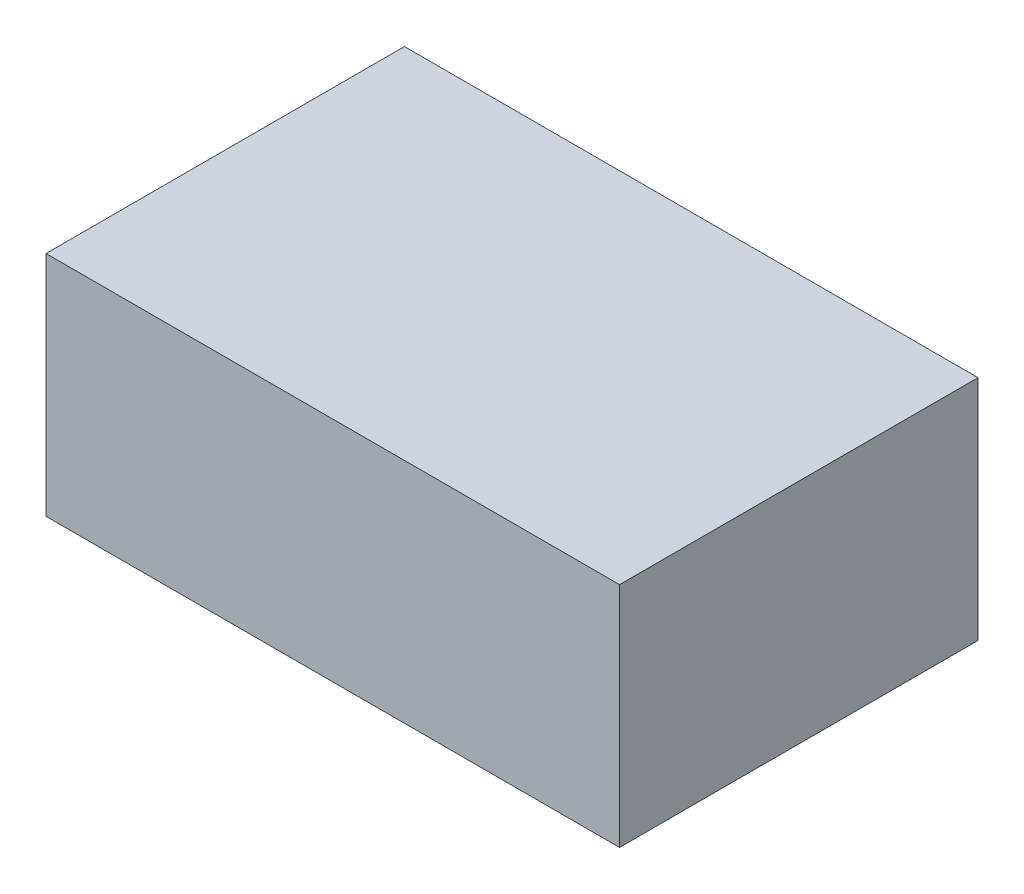
ISO-10303-21;
HEADER;
FILE_DESCRIPTION(('STEP AP214'),'2;1');
FILE_NAME('part.step','',(''),(''),'','','');
FILE_SCHEMA(('AUTOMOTIVE_DESIGN { 1 0 10303 214 1 1 1 1 }'));
ENDSEC;
DATA;
#1=APPLICATION_CONTEXT('core data for automotive mechanical design processes');
#2=APPLICATION_PROTOCOL_DEFINITION('international standard','automotive_design',2000,#1);
#3=PRODUCT_CONTEXT('',#1,'mechanical');
#4=PRODUCT('Part','Part','',(#3));
#5=PRODUCT_RELATED_PRODUCT_CATEGORY('part','',(#4));
#6=PRODUCT_DEFINITION_FORMATION('','',#4);
#7=PRODUCT_DEFINITION_CONTEXT('part definition',#1,'design');
#8=PRODUCT_DEFINITION('design','',#6,#7);
#9=PRODUCT_DEFINITION_SHAPE('','',#8);
#10=(LENGTH_UNIT() NAMED_UNIT(*) SI_UNIT(.MILLI.,.METRE.));
#11=(NAMED_UNIT(*) PLANE_ANGLE_UNIT() SI_UNIT($,.RADIAN.));
#12=(NAMED_UNIT(*) SI_UNIT($,.STERADIAN.) SOLID_ANGLE_UNIT());
#13=UNCERTAINTY_MEASURE_WITH_UNIT(LENGTH_MEASURE(1.E-05),#10,'distance_accuracy_value','');
#14=(GEOMETRIC_REPRESENTATION_CONTEXT(3) GLOBAL_UNCERTAINTY_ASSIGNED_CONTEXT((#13)) GLOBAL_UNIT_ASSIGNED_CONTEXT((#10,
#11,#12)) REPRESENTATION_CONTEXT('',''));
#15=CARTESIAN_POINT('',(0.,0.,0.));
#16=DIRECTION('',(0.,0.,1.));
#17=DIRECTION('',(1.,0.,0.));
#18=AXIS2_PLACEMENT_3D('',#15,#16,#17);
#19=CARTESIAN_POINT('',(-4.,3.175,-2.5));
#20=DIRECTION('',(1.,0.,0.));
#21=DIRECTION('',(0.,0.,-1.));
#22=AXIS2_PLACEMENT_3D('',#19,#20,#21);
#23=PLANE('',#22);
#24=DIRECTION('',(0.,0.,1.));
#25=VECTOR('',#24,1.);
#26=CARTESIAN_POINT('',(-4.,0.,-2.5));
#27=LINE('',#26,#25);
#28=CARTESIAN_POINT('',(-4.,0.,-2.5));
#29=VERTEX_POINT('',#28);
#30=CARTESIAN_POINT('',(-4.,0.,2.5));
#31=VERTEX_POINT('',#30);
#32=EDGE_CURVE('E98',#29,#31,#27,.T.);
#33=ORIENTED_EDGE('',*,*,#32,.T.);
#34=DIRECTION('',(0.,-1.,0.));
#35=VECTOR('',#34,1.);
#36=CARTESIAN_POINT('',(-4.,3.175,2.5));
#37=LINE('',#36,#35);
#38=CARTESIAN_POINT('',(-4.,3.175,2.5));
#39=VERTEX_POINT('',#38);
#40=EDGE_CURVE('E11',#39,#31,#37,.T.);
#41=ORIENTED_EDGE('',*,*,#40,.F.);
#42=DIRECTION('',(0.,0.,1.));
#43=VECTOR('',#42,1.);
#44=CARTESIAN_POINT('',(-4.,3.175,-2.5));
#45=LINE('',#44,#43);
#46=CARTESIAN_POINT('',(-4.,3.175,-2.5));
#47=VERTEX_POINT('',#46);
#48=EDGE_CURVE('E86',#47,#39,#45,.T.);
#49=ORIENTED_EDGE('',*,*,#48,.F.);
#50=DIRECTION('',(0.,-1.,0.));
#51=VECTOR('',#50,1.);
#52=CARTESIAN_POINT('',(-4.,3.175,-2.5));
#53=LINE('',#52,#51);
#54=EDGE_CURVE('E94',#47,#29,#53,.T.);
#55=ORIENTED_EDGE('',*,*,#54,.T.);
#56=EDGE_LOOP('',(#33,#41,#49,#55));
#57=FACE_BOUND('',#56,.T.);
#58=ADVANCED_FACE('F35',(#57),#23,.F.);
#59=CARTESIAN_POINT('',(-4.,3.175,2.5));
#60=DIRECTION('',(0.,0.,-1.));
#61=DIRECTION('',(-1.,0.,0.));
#62=AXIS2_PLACEMENT_3D('',#59,#60,#61);
#63=PLANE('',#62);
#64=DIRECTION('',(1.,0.,0.));
#65=VECTOR('',#64,1.);
#66=CARTESIAN_POINT('',(-4.,0.,2.5));
#67=LINE('',#66,#65);
#68=CARTESIAN_POINT('',(4.,0.,2.5));
#69=VERTEX_POINT('',#68);
#70=EDGE_CURVE('E90',#31,#69,#67,.T.);
#71=ORIENTED_EDGE('',*,*,#70,.T.);
#72=DIRECTION('',(0.,-1.,0.));
#73=VECTOR('',#72,1.);
#74=CARTESIAN_POINT('',(4.,3.175,2.5));
#75=LINE('',#74,#73);
#76=CARTESIAN_POINT('',(4.,3.175,2.5));
#77=VERTEX_POINT('',#76);
#78=EDGE_CURVE('E43',#77,#69,#75,.T.);
#79=ORIENTED_EDGE('',*,*,#78,.F.);
#80=DIRECTION('',(1.,0.,0.));
#81=VECTOR('',#80,1.);
#82=CARTESIAN_POINT('',(-4.,3.175,2.5));
#83=LINE('',#82,#81);
#84=EDGE_CURVE('E81',#39,#77,#83,.T.);
#85=ORIENTED_EDGE('',*,*,#84,.F.);
#86=ORIENTED_EDGE('',*,*,#40,.T.);
#87=EDGE_LOOP('',(#71,#79,#85,#86));
#88=FACE_BOUND('',#87,.T.);
#89=ADVANCED_FACE('F89',(#88),#63,.F.);
#90=CARTESIAN_POINT('',(4.,3.175,-2.5));
#91=DIRECTION('',(-1.,0.,0.));
#92=DIRECTION('',(0.,0.,1.));
#93=AXIS2_PLACEMENT_3D('',#90,#91,#92);
#94=PLANE('',#93);
#95=DIRECTION('',(0.,0.,-1.));
#96=VECTOR('',#95,1.);
#97=CARTESIAN_POINT('',(4.,0.,-2.5));
#98=LINE('',#97,#96);
#99=CARTESIAN_POINT('',(4.,0.,-2.5));
#100=VERTEX_POINT('',#99);
#101=EDGE_CURVE('E68',#69,#100,#98,.T.);
#102=ORIENTED_EDGE('',*,*,#101,.T.);
#103=DIRECTION('',(0.,-1.,0.));
#104=VECTOR('',#103,1.);
#105=CARTESIAN_POINT('',(4.,3.175,-2.5));
#106=LINE('',#105,#104);
#107=CARTESIAN_POINT('',(4.,3.175,-2.5));
#108=VERTEX_POINT('',#107);
#109=EDGE_CURVE('E91',#108,#100,#106,.T.);
#110=ORIENTED_EDGE('',*,*,#109,.F.);
#111=DIRECTION('',(0.,0.,-1.));
#112=VECTOR('',#111,1.);
#113=CARTESIAN_POINT('',(4.,3.175,-2.5));
#114=LINE('',#113,#112);
#115=EDGE_CURVE('E84',#77,#108,#114,.T.);
#116=ORIENTED_EDGE('',*,*,#115,.F.);
#117=ORIENTED_EDGE('',*,*,#78,.T.);
#118=EDGE_LOOP('',(#102,#110,#116,#117));
#119=FACE_BOUND('',#118,.T.);
#120=ADVANCED_FACE('F92',(#119),#94,.F.);
#121=CARTESIAN_POINT('',(-4.,3.175,-2.5));
#122=DIRECTION('',(0.,0.,1.));
#123=DIRECTION('',(1.,0.,0.));
#124=AXIS2_PLACEMENT_3D('',#121,#122,#123);
#125=PLANE('',#124);
#126=DIRECTION('',(-1.,0.,0.));
#127=VECTOR('',#126,1.);
#128=CARTESIAN_POINT('',(-4.,0.,-2.5));
#129=LINE('',#128,#127);
#130=EDGE_CURVE('E74',#100,#29,#129,.T.);
#131=ORIENTED_EDGE('',*,*,#130,.T.);
#132=ORIENTED_EDGE('',*,*,#54,.F.);
#133=DIRECTION('',(-1.,0.,0.));
#134=VECTOR('',#133,1.);
#135=CARTESIAN_POINT('',(-4.,3.175,-2.5));
#136=LINE('',#135,#134);
#137=EDGE_CURVE('E51',#108,#47,#136,.T.);
#138=ORIENTED_EDGE('',*,*,#137,.F.);
#139=ORIENTED_EDGE('',*,*,#109,.T.);
#140=EDGE_LOOP('',(#131,#132,#138,#139));
#141=FACE_BOUND('',#140,.T.);
#142=ADVANCED_FACE('F105',(#141),#125,.F.);
#143=CARTESIAN_POINT('',(0.,3.175,0.));
#144=DIRECTION('',(0.,1.,0.));
#145=DIRECTION('',(0.,0.,1.));
#146=AXIS2_PLACEMENT_3D('',#143,#144,#145);
#147=PLANE('',#146);
#148=ORIENTED_EDGE('',*,*,#48,.T.);
#149=ORIENTED_EDGE('',*,*,#84,.T.);
#150=ORIENTED_EDGE('',*,*,#115,.T.);
#151=ORIENTED_EDGE('',*,*,#137,.T.);
#152=EDGE_LOOP('',(#148,#149,#150,#151));
#153=FACE_BOUND('',#152,.T.);
#154=ADVANCED_FACE('F82',(#153),#147,.T.);
#155=CARTESIAN_POINT('',(0.,0.,0.));
#156=DIRECTION('',(0.,1.,0.));
#157=DIRECTION('',(0.,0.,1.));
#158=AXIS2_PLACEMENT_3D('',#155,#156,#157);
#159=PLANE('',#158);
#160=ORIENTED_EDGE('',*,*,#32,.F.);
#161=ORIENTED_EDGE('',*,*,#130,.F.);
#162=ORIENTED_EDGE('',*,*,#101,.F.);
#163=ORIENTED_EDGE('',*,*,#70,.F.);
#164=EDGE_LOOP('',(#160,#161,#162,#163));
#165=FACE_BOUND('',#164,.T.);
#166=ADVANCED_FACE('F108',(#165),#159,.F.);
#167=CLOSED_SHELL('',(#58,#89,#120,#142,#154,#166));
#168=MANIFOLD_SOLID_BREP('B2',#167);
#169=ADVANCED_BREP_SHAPE_REPRESENTATION('',(#18,#168),#14);
#170=SHAPE_DEFINITION_REPRESENTATION(#9,#169);
ENDSEC;
END-ISO-10303-21;
